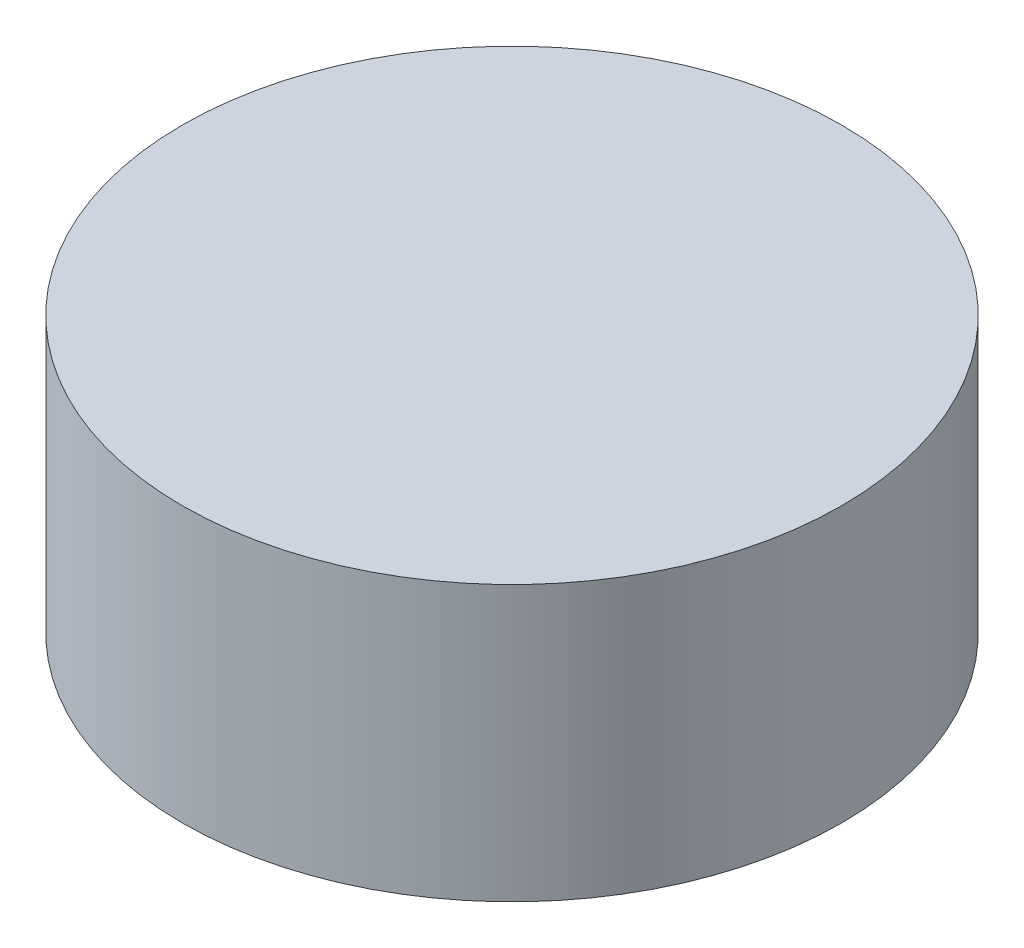
ISO-10303-21;
HEADER;
FILE_DESCRIPTION(('STEP AP214'),'2;1');
FILE_NAME('part.step','',(''),(''),'','','');
FILE_SCHEMA(('AUTOMOTIVE_DESIGN { 1 0 10303 214 1 1 1 1 }'));
ENDSEC;
DATA;
#1=APPLICATION_CONTEXT('core data for automotive mechanical design processes');
#2=APPLICATION_PROTOCOL_DEFINITION('international standard','automotive_design',2000,#1);
#3=PRODUCT_CONTEXT('',#1,'mechanical');
#4=PRODUCT('Part','Part','',(#3));
#5=PRODUCT_RELATED_PRODUCT_CATEGORY('part','',(#4));
#6=PRODUCT_DEFINITION_FORMATION('','',#4);
#7=PRODUCT_DEFINITION_CONTEXT('part definition',#1,'design');
#8=PRODUCT_DEFINITION('design','',#6,#7);
#9=PRODUCT_DEFINITION_SHAPE('','',#8);
#10=(LENGTH_UNIT() NAMED_UNIT(*) SI_UNIT(.MILLI.,.METRE.));
#11=(NAMED_UNIT(*) PLANE_ANGLE_UNIT() SI_UNIT($,.RADIAN.));
#12=(NAMED_UNIT(*) SI_UNIT($,.STERADIAN.) SOLID_ANGLE_UNIT());
#13=UNCERTAINTY_MEASURE_WITH_UNIT(LENGTH_MEASURE(1.E-05),#10,'distance_accuracy_value','');
#14=(GEOMETRIC_REPRESENTATION_CONTEXT(3) GLOBAL_UNCERTAINTY_ASSIGNED_CONTEXT((#13)) GLOBAL_UNIT_ASSIGNED_CONTEXT((#10,
#11,#12)) REPRESENTATION_CONTEXT('',''));
#15=CARTESIAN_POINT('',(0.,0.,0.));
#16=DIRECTION('',(0.,0.,1.));
#17=DIRECTION('',(1.,0.,0.));
#18=AXIS2_PLACEMENT_3D('',#15,#16,#17);
#19=CARTESIAN_POINT('',(0.,2.5,0.));
#20=DIRECTION('',(0.,-1.,0.));
#21=DIRECTION('',(0.,0.,-1.));
#22=AXIS2_PLACEMENT_3D('',#19,#20,#21);
#23=CYLINDRICAL_SURFACE('',#22,3.);
#24=CARTESIAN_POINT('',(0.,2.5,0.));
#25=DIRECTION('',(0.,1.,0.));
#26=DIRECTION('',(0.,0.,1.));
#27=AXIS2_PLACEMENT_3D('',#24,#25,#26);
#28=CIRCLE('',#27,3.);
#29=CARTESIAN_POINT('',(0.,2.5,3.));
#30=VERTEX_POINT('',#29);
#31=EDGE_CURVE('E10',#30,#30,#28,.T.);
#32=ORIENTED_EDGE('',*,*,#31,.F.);
#33=EDGE_LOOP('',(#32));
#34=FACE_BOUND('',#33,.T.);
#35=CARTESIAN_POINT('',(0.,0.,0.));
#36=DIRECTION('',(0.,1.,0.));
#37=DIRECTION('',(0.,0.,1.));
#38=AXIS2_PLACEMENT_3D('',#35,#36,#37);
#39=CIRCLE('',#38,3.);
#40=CARTESIAN_POINT('',(0.,0.,3.));
#41=VERTEX_POINT('',#40);
#42=EDGE_CURVE('E46',#41,#41,#39,.T.);
#43=ORIENTED_EDGE('',*,*,#42,.T.);
#44=EDGE_LOOP('',(#43));
#45=FACE_BOUND('',#44,.T.);
#46=ADVANCED_FACE('F43',(#34,#45),#23,.T.);
#47=CARTESIAN_POINT('',(0.,2.5,0.));
#48=DIRECTION('',(0.,1.,0.));
#49=DIRECTION('',(0.,0.,1.));
#50=AXIS2_PLACEMENT_3D('',#47,#48,#49);
#51=PLANE('',#50);
#52=ORIENTED_EDGE('',*,*,#31,.T.);
#53=EDGE_LOOP('',(#52));
#54=FACE_BOUND('',#53,.T.);
#55=ADVANCED_FACE('F60',(#54),#51,.T.);
#56=CARTESIAN_POINT('',(0.,0.,0.));
#57=DIRECTION('',(0.,1.,0.));
#58=DIRECTION('',(0.,0.,1.));
#59=AXIS2_PLACEMENT_3D('',#56,#57,#58);
#60=PLANE('',#59);
#61=ORIENTED_EDGE('',*,*,#42,.F.);
#62=EDGE_LOOP('',(#61));
#63=FACE_BOUND('',#62,.T.);
#64=ADVANCED_FACE('F58',(#63),#60,.F.);
#65=CLOSED_SHELL('',(#46,#55,#64));
#66=MANIFOLD_SOLID_BREP('B2',#65);
#67=ADVANCED_BREP_SHAPE_REPRESENTATION('',(#18,#66),#14);
#68=SHAPE_DEFINITION_REPRESENTATION(#9,#67);
ENDSEC;
END-ISO-10303-21;
